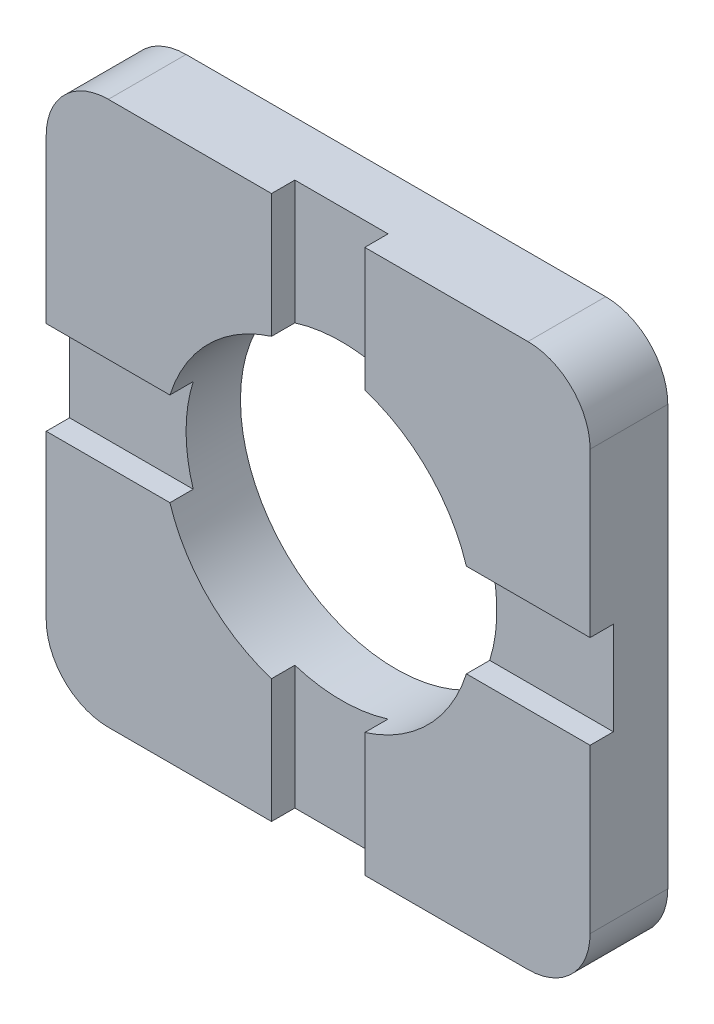
ISO-10303-21;
HEADER;
FILE_DESCRIPTION(('STEP AP214'),'2;1');
FILE_NAME('part.step','',(''),(''),'','','');
FILE_SCHEMA(('AUTOMOTIVE_DESIGN { 1 0 10303 214 1 1 1 1 }'));
ENDSEC;
DATA;
#1=APPLICATION_CONTEXT('core data for automotive mechanical design processes');
#2=APPLICATION_PROTOCOL_DEFINITION('international standard','automotive_design',2000,#1);
#3=PRODUCT_CONTEXT('',#1,'mechanical');
#4=PRODUCT('Part','Part','',(#3));
#5=PRODUCT_RELATED_PRODUCT_CATEGORY('part','',(#4));
#6=PRODUCT_DEFINITION_FORMATION('','',#4);
#7=PRODUCT_DEFINITION_CONTEXT('part definition',#1,'design');
#8=PRODUCT_DEFINITION('design','',#6,#7);
#9=PRODUCT_DEFINITION_SHAPE('','',#8);
#10=(LENGTH_UNIT() NAMED_UNIT(*) SI_UNIT(.MILLI.,.METRE.));
#11=(NAMED_UNIT(*) PLANE_ANGLE_UNIT() SI_UNIT($,.RADIAN.));
#12=(NAMED_UNIT(*) SI_UNIT($,.STERADIAN.) SOLID_ANGLE_UNIT());
#13=UNCERTAINTY_MEASURE_WITH_UNIT(LENGTH_MEASURE(1.E-05),#10,'distance_accuracy_value','');
#14=(GEOMETRIC_REPRESENTATION_CONTEXT(3) GLOBAL_UNCERTAINTY_ASSIGNED_CONTEXT((#13)) GLOBAL_UNIT_ASSIGNED_CONTEXT((#10,
#11,#12)) REPRESENTATION_CONTEXT('',''));
#15=CARTESIAN_POINT('',(0.,0.,0.));
#16=DIRECTION('',(0.,0.,1.));
#17=DIRECTION('',(1.,0.,0.));
#18=AXIS2_PLACEMENT_3D('',#15,#16,#17);
#19=CARTESIAN_POINT('',(0.,0.6,0.7));
#20=DIRECTION('',(0.,1.,0.));
#21=DIRECTION('',(0.,0.,1.));
#22=AXIS2_PLACEMENT_3D('',#19,#20,#21);
#23=PLANE('',#22);
#24=DIRECTION('',(0.,0.,1.));
#25=VECTOR('',#24,1.);
#26=CARTESIAN_POINT('',(-3.5,0.6,0.7));
#27=LINE('',#26,#25);
#28=CARTESIAN_POINT('',(-3.5,0.6,0.7));
#29=VERTEX_POINT('',#28);
#30=CARTESIAN_POINT('',(-3.5,0.6,1.));
#31=VERTEX_POINT('',#30);
#32=EDGE_CURVE('E257',#29,#31,#27,.T.);
#33=ORIENTED_EDGE('',*,*,#32,.F.);
#34=DIRECTION('',(1.,0.,0.));
#35=VECTOR('',#34,1.);
#36=CARTESIAN_POINT('',(0.,0.6,0.7));
#37=LINE('',#36,#35);
#38=CARTESIAN_POINT('',(-1.9078784028339,0.6,0.7));
#39=VERTEX_POINT('',#38);
#40=EDGE_CURVE('E342',#39,#29,#37,.F.);
#41=ORIENTED_EDGE('',*,*,#40,.F.);
#42=DIRECTION('',(0.,0.,1.));
#43=VECTOR('',#42,1.);
#44=CARTESIAN_POINT('',(-1.9078784028339,0.6,0.7));
#45=LINE('',#44,#43);
#46=CARTESIAN_POINT('',(-1.9078784028339,0.6,1.));
#47=VERTEX_POINT('',#46);
#48=EDGE_CURVE('E266',#47,#39,#45,.F.);
#49=ORIENTED_EDGE('',*,*,#48,.F.);
#50=DIRECTION('',(1.,0.,0.));
#51=VECTOR('',#50,1.);
#52=CARTESIAN_POINT('',(-2.7,0.6,1.));
#53=LINE('',#52,#51);
#54=EDGE_CURVE('E403',#31,#47,#53,.T.);
#55=ORIENTED_EDGE('',*,*,#54,.F.);
#56=EDGE_LOOP('',(#33,#41,#49,#55));
#57=FACE_BOUND('',#56,.T.);
#58=ADVANCED_FACE('F16',(#57),#23,.F.);
#59=CARTESIAN_POINT('',(-0.6,0.,0.7));
#60=DIRECTION('',(1.,0.,0.));
#61=DIRECTION('',(0.,0.,-1.));
#62=AXIS2_PLACEMENT_3D('',#59,#60,#61);
#63=PLANE('',#62);
#64=DIRECTION('',(0.,1.,0.));
#65=VECTOR('',#64,1.);
#66=CARTESIAN_POINT('',(-0.6,0.,0.7));
#67=LINE('',#66,#65);
#68=CARTESIAN_POINT('',(-0.6,3.5,0.7));
#69=VERTEX_POINT('',#68);
#70=CARTESIAN_POINT('',(-0.6,1.90787840283389,0.7));
#71=VERTEX_POINT('',#70);
#72=EDGE_CURVE('E409',#69,#71,#67,.F.);
#73=ORIENTED_EDGE('',*,*,#72,.F.);
#74=DIRECTION('',(0.,0.,-1.));
#75=VECTOR('',#74,1.);
#76=CARTESIAN_POINT('',(-0.6,3.5,0.7));
#77=LINE('',#76,#75);
#78=CARTESIAN_POINT('',(-0.6,3.5,1.));
#79=VERTEX_POINT('',#78);
#80=EDGE_CURVE('E243',#69,#79,#77,.F.);
#81=ORIENTED_EDGE('',*,*,#80,.T.);
#82=DIRECTION('',(0.,1.,0.));
#83=VECTOR('',#82,1.);
#84=CARTESIAN_POINT('',(-0.6,-2.7,1.));
#85=LINE('',#84,#83);
#86=CARTESIAN_POINT('',(-0.6,1.90787840283389,1.));
#87=VERTEX_POINT('',#86);
#88=EDGE_CURVE('E386',#87,#79,#85,.T.);
#89=ORIENTED_EDGE('',*,*,#88,.F.);
#90=DIRECTION('',(0.,0.,-1.));
#91=VECTOR('',#90,1.);
#92=CARTESIAN_POINT('',(-0.6,1.90787840283389,0.7));
#93=LINE('',#92,#91);
#94=EDGE_CURVE('E254',#87,#71,#93,.T.);
#95=ORIENTED_EDGE('',*,*,#94,.T.);
#96=EDGE_LOOP('',(#73,#81,#89,#95));
#97=FACE_BOUND('',#96,.T.);
#98=ADVANCED_FACE('F754',(#97),#63,.T.);
#99=CARTESIAN_POINT('',(0.,0.6,0.7));
#100=DIRECTION('',(0.,1.,0.));
#101=DIRECTION('',(0.,0.,1.));
#102=AXIS2_PLACEMENT_3D('',#99,#100,#101);
#103=PLANE('',#102);
#104=DIRECTION('',(0.,0.,1.));
#105=VECTOR('',#104,1.);
#106=CARTESIAN_POINT('',(1.90787840283389,0.6,0.7));
#107=LINE('',#106,#105);
#108=CARTESIAN_POINT('',(1.90787840283389,0.6,0.7));
#109=VERTEX_POINT('',#108);
#110=CARTESIAN_POINT('',(1.90787840283389,0.6,1.));
#111=VERTEX_POINT('',#110);
#112=EDGE_CURVE('E147',#109,#111,#107,.T.);
#113=ORIENTED_EDGE('',*,*,#112,.F.);
#114=DIRECTION('',(1.,0.,0.));
#115=VECTOR('',#114,1.);
#116=CARTESIAN_POINT('',(0.,0.6,0.7));
#117=LINE('',#116,#115);
#118=CARTESIAN_POINT('',(3.5,0.6,0.7));
#119=VERTEX_POINT('',#118);
#120=EDGE_CURVE('E154',#119,#109,#117,.F.);
#121=ORIENTED_EDGE('',*,*,#120,.F.);
#122=DIRECTION('',(0.,0.,1.));
#123=VECTOR('',#122,1.);
#124=CARTESIAN_POINT('',(3.5,0.6,0.7));
#125=LINE('',#124,#123);
#126=CARTESIAN_POINT('',(3.5,0.6,1.));
#127=VERTEX_POINT('',#126);
#128=EDGE_CURVE('E166',#127,#119,#125,.F.);
#129=ORIENTED_EDGE('',*,*,#128,.F.);
#130=DIRECTION('',(1.,0.,0.));
#131=VECTOR('',#130,1.);
#132=CARTESIAN_POINT('',(-2.7,0.6,1.));
#133=LINE('',#132,#131);
#134=EDGE_CURVE('E162',#111,#127,#133,.T.);
#135=ORIENTED_EDGE('',*,*,#134,.F.);
#136=EDGE_LOOP('',(#113,#121,#129,#135));
#137=FACE_BOUND('',#136,.T.);
#138=ADVANCED_FACE('F157',(#137),#103,.F.);
#139=CARTESIAN_POINT('',(0.6,0.,0.7));
#140=DIRECTION('',(1.,0.,0.));
#141=DIRECTION('',(0.,0.,-1.));
#142=AXIS2_PLACEMENT_3D('',#139,#140,#141);
#143=PLANE('',#142);
#144=DIRECTION('',(0.,0.,-1.));
#145=VECTOR('',#144,1.);
#146=CARTESIAN_POINT('',(0.6,3.5,0.7));
#147=LINE('',#146,#145);
#148=CARTESIAN_POINT('',(0.6,3.5,0.7));
#149=VERTEX_POINT('',#148);
#150=CARTESIAN_POINT('',(0.6,3.5,1.));
#151=VERTEX_POINT('',#150);
#152=EDGE_CURVE('E228',#149,#151,#147,.F.);
#153=ORIENTED_EDGE('',*,*,#152,.F.);
#154=DIRECTION('',(0.,1.,0.));
#155=VECTOR('',#154,1.);
#156=CARTESIAN_POINT('',(0.6,0.,0.7));
#157=LINE('',#156,#155);
#158=CARTESIAN_POINT('',(0.6,1.90787840283389,0.7));
#159=VERTEX_POINT('',#158);
#160=EDGE_CURVE('E415',#159,#149,#157,.T.);
#161=ORIENTED_EDGE('',*,*,#160,.F.);
#162=DIRECTION('',(0.,0.,-1.));
#163=VECTOR('',#162,1.);
#164=CARTESIAN_POINT('',(0.6,1.90787840283389,0.7));
#165=LINE('',#164,#163);
#166=CARTESIAN_POINT('',(0.6,1.90787840283389,1.));
#167=VERTEX_POINT('',#166);
#168=EDGE_CURVE('E165',#167,#159,#165,.T.);
#169=ORIENTED_EDGE('',*,*,#168,.F.);
#170=DIRECTION('',(0.,1.,0.));
#171=VECTOR('',#170,1.);
#172=CARTESIAN_POINT('',(0.6,-2.7,1.));
#173=LINE('',#172,#171);
#174=EDGE_CURVE('E424',#151,#167,#173,.F.);
#175=ORIENTED_EDGE('',*,*,#174,.F.);
#176=EDGE_LOOP('',(#153,#161,#169,#175));
#177=FACE_BOUND('',#176,.T.);
#178=ADVANCED_FACE('F735',(#177),#143,.F.);
#179=CARTESIAN_POINT('',(0.,-0.6,0.7));
#180=DIRECTION('',(0.,1.,0.));
#181=DIRECTION('',(0.,0.,1.));
#182=AXIS2_PLACEMENT_3D('',#179,#180,#181);
#183=PLANE('',#182);
#184=DIRECTION('',(1.,0.,0.));
#185=VECTOR('',#184,1.);
#186=CARTESIAN_POINT('',(0.,-0.6,0.7));
#187=LINE('',#186,#185);
#188=CARTESIAN_POINT('',(1.90787840283389,-0.6,0.7));
#189=VERTEX_POINT('',#188);
#190=CARTESIAN_POINT('',(3.5,-0.6,0.7));
#191=VERTEX_POINT('',#190);
#192=EDGE_CURVE('E153',#189,#191,#187,.T.);
#193=ORIENTED_EDGE('',*,*,#192,.F.);
#194=DIRECTION('',(0.,0.,1.));
#195=VECTOR('',#194,1.);
#196=CARTESIAN_POINT('',(1.90787840283389,-0.6,0.7));
#197=LINE('',#196,#195);
#198=CARTESIAN_POINT('',(1.90787840283389,-0.6,1.));
#199=VERTEX_POINT('',#198);
#200=EDGE_CURVE('E150',#189,#199,#197,.T.);
#201=ORIENTED_EDGE('',*,*,#200,.T.);
#202=DIRECTION('',(1.,0.,0.));
#203=VECTOR('',#202,1.);
#204=CARTESIAN_POINT('',(-2.7,-0.6,1.));
#205=LINE('',#204,#203);
#206=CARTESIAN_POINT('',(3.5,-0.6,1.));
#207=VERTEX_POINT('',#206);
#208=EDGE_CURVE('E430',#207,#199,#205,.F.);
#209=ORIENTED_EDGE('',*,*,#208,.F.);
#210=DIRECTION('',(0.,0.,1.));
#211=VECTOR('',#210,1.);
#212=CARTESIAN_POINT('',(3.5,-0.6,0.7));
#213=LINE('',#212,#211);
#214=EDGE_CURVE('E224',#207,#191,#213,.F.);
#215=ORIENTED_EDGE('',*,*,#214,.T.);
#216=EDGE_LOOP('',(#193,#201,#209,#215));
#217=FACE_BOUND('',#216,.T.);
#218=ADVANCED_FACE('F725',(#217),#183,.T.);
#219=CARTESIAN_POINT('',(0.6,0.,0.7));
#220=DIRECTION('',(1.,0.,0.));
#221=DIRECTION('',(0.,0.,-1.));
#222=AXIS2_PLACEMENT_3D('',#219,#220,#221);
#223=PLANE('',#222);
#224=DIRECTION('',(0.,0.,-1.));
#225=VECTOR('',#224,1.);
#226=CARTESIAN_POINT('',(0.6,-1.90787840283389,0.7));
#227=LINE('',#226,#225);
#228=CARTESIAN_POINT('',(0.6,-1.90787840283389,0.7));
#229=VERTEX_POINT('',#228);
#230=CARTESIAN_POINT('',(0.6,-1.90787840283389,1.));
#231=VERTEX_POINT('',#230);
#232=EDGE_CURVE('E205',#229,#231,#227,.F.);
#233=ORIENTED_EDGE('',*,*,#232,.F.);
#234=DIRECTION('',(0.,1.,0.));
#235=VECTOR('',#234,1.);
#236=CARTESIAN_POINT('',(0.6,0.,0.7));
#237=LINE('',#236,#235);
#238=CARTESIAN_POINT('',(0.6,-3.5,0.7));
#239=VERTEX_POINT('',#238);
#240=EDGE_CURVE('E448',#239,#229,#237,.T.);
#241=ORIENTED_EDGE('',*,*,#240,.F.);
#242=DIRECTION('',(0.,0.,-1.));
#243=VECTOR('',#242,1.);
#244=CARTESIAN_POINT('',(0.6,-3.5,0.7));
#245=LINE('',#244,#243);
#246=CARTESIAN_POINT('',(0.6,-3.5,1.));
#247=VERTEX_POINT('',#246);
#248=EDGE_CURVE('E212',#247,#239,#245,.T.);
#249=ORIENTED_EDGE('',*,*,#248,.F.);
#250=DIRECTION('',(0.,1.,0.));
#251=VECTOR('',#250,1.);
#252=CARTESIAN_POINT('',(0.6,-2.7,1.));
#253=LINE('',#252,#251);
#254=EDGE_CURVE('E436',#231,#247,#253,.F.);
#255=ORIENTED_EDGE('',*,*,#254,.F.);
#256=EDGE_LOOP('',(#233,#241,#249,#255));
#257=FACE_BOUND('',#256,.T.);
#258=ADVANCED_FACE('F715',(#257),#223,.F.);
#259=CARTESIAN_POINT('',(-0.6,0.,0.7));
#260=DIRECTION('',(1.,0.,0.));
#261=DIRECTION('',(0.,0.,-1.));
#262=AXIS2_PLACEMENT_3D('',#259,#260,#261);
#263=PLANE('',#262);
#264=DIRECTION('',(0.,1.,0.));
#265=VECTOR('',#264,1.);
#266=CARTESIAN_POINT('',(-0.6,0.,0.7));
#267=LINE('',#266,#265);
#268=CARTESIAN_POINT('',(-0.6,-1.90787840283389,0.7));
#269=VERTEX_POINT('',#268);
#270=CARTESIAN_POINT('',(-0.6,-3.5,0.7));
#271=VERTEX_POINT('',#270);
#272=EDGE_CURVE('E442',#269,#271,#267,.F.);
#273=ORIENTED_EDGE('',*,*,#272,.F.);
#274=DIRECTION('',(0.,0.,-1.));
#275=VECTOR('',#274,1.);
#276=CARTESIAN_POINT('',(-0.6,-1.90787840283389,0.7));
#277=LINE('',#276,#275);
#278=CARTESIAN_POINT('',(-0.6,-1.90787840283389,1.));
#279=VERTEX_POINT('',#278);
#280=EDGE_CURVE('E197',#269,#279,#277,.F.);
#281=ORIENTED_EDGE('',*,*,#280,.T.);
#282=DIRECTION('',(0.,1.,0.));
#283=VECTOR('',#282,1.);
#284=CARTESIAN_POINT('',(-0.6,-2.7,1.));
#285=LINE('',#284,#283);
#286=CARTESIAN_POINT('',(-0.6,-3.5,1.));
#287=VERTEX_POINT('',#286);
#288=EDGE_CURVE('E454',#287,#279,#285,.T.);
#289=ORIENTED_EDGE('',*,*,#288,.F.);
#290=DIRECTION('',(0.,0.,-1.));
#291=VECTOR('',#290,1.);
#292=CARTESIAN_POINT('',(-0.6,-3.5,0.7));
#293=LINE('',#292,#291);
#294=EDGE_CURVE('E201',#287,#271,#293,.T.);
#295=ORIENTED_EDGE('',*,*,#294,.T.);
#296=EDGE_LOOP('',(#273,#281,#289,#295));
#297=FACE_BOUND('',#296,.T.);
#298=ADVANCED_FACE('F705',(#297),#263,.T.);
#299=CARTESIAN_POINT('',(0.,-0.6,0.7));
#300=DIRECTION('',(0.,1.,0.));
#301=DIRECTION('',(0.,0.,1.));
#302=AXIS2_PLACEMENT_3D('',#299,#300,#301);
#303=PLANE('',#302);
#304=DIRECTION('',(1.,0.,0.));
#305=VECTOR('',#304,1.);
#306=CARTESIAN_POINT('',(0.,-0.6,0.7));
#307=LINE('',#306,#305);
#308=CARTESIAN_POINT('',(-3.5,-0.6,0.7));
#309=VERTEX_POINT('',#308);
#310=CARTESIAN_POINT('',(-1.90787840283389,-0.6,0.7));
#311=VERTEX_POINT('',#310);
#312=EDGE_CURVE('E349',#309,#311,#307,.T.);
#313=ORIENTED_EDGE('',*,*,#312,.F.);
#314=DIRECTION('',(0.,0.,1.));
#315=VECTOR('',#314,1.);
#316=CARTESIAN_POINT('',(-3.5,-0.6,0.7));
#317=LINE('',#316,#315);
#318=CARTESIAN_POINT('',(-3.5,-0.6,1.));
#319=VERTEX_POINT('',#318);
#320=EDGE_CURVE('E172',#309,#319,#317,.T.);
#321=ORIENTED_EDGE('',*,*,#320,.T.);
#322=DIRECTION('',(1.,0.,0.));
#323=VECTOR('',#322,1.);
#324=CARTESIAN_POINT('',(-2.7,-0.6,1.));
#325=LINE('',#324,#323);
#326=CARTESIAN_POINT('',(-1.90787840283389,-0.6,1.));
#327=VERTEX_POINT('',#326);
#328=EDGE_CURVE('E221',#327,#319,#325,.F.);
#329=ORIENTED_EDGE('',*,*,#328,.F.);
#330=DIRECTION('',(0.,0.,1.));
#331=VECTOR('',#330,1.);
#332=CARTESIAN_POINT('',(-1.90787840283389,-0.6,0.7));
#333=LINE('',#332,#331);
#334=EDGE_CURVE('E179',#327,#311,#333,.F.);
#335=ORIENTED_EDGE('',*,*,#334,.T.);
#336=EDGE_LOOP('',(#313,#321,#329,#335));
#337=FACE_BOUND('',#336,.T.);
#338=ADVANCED_FACE('F696',(#337),#303,.T.);
#339=CARTESIAN_POINT('',(0.,0.,0.7));
#340=DIRECTION('',(0.,0.,1.));
#341=DIRECTION('',(1.,0.,0.));
#342=AXIS2_PLACEMENT_3D('',#339,#340,#341);
#343=PLANE('',#342);
#344=CARTESIAN_POINT('',(0.,0.,0.7));
#345=DIRECTION('',(0.,0.,-1.));
#346=DIRECTION('',(-1.,0.,0.));
#347=AXIS2_PLACEMENT_3D('',#344,#345,#346);
#348=CIRCLE('',#347,2.);
#349=EDGE_CURVE('E19',#109,#189,#348,.T.);
#350=ORIENTED_EDGE('',*,*,#349,.T.);
#351=ORIENTED_EDGE('',*,*,#192,.T.);
#352=DIRECTION('',(0.,-1.,0.));
#353=VECTOR('',#352,1.);
#354=CARTESIAN_POINT('',(3.5,2.7,0.7));
#355=LINE('',#354,#353);
#356=EDGE_CURVE('E170',#191,#119,#355,.F.);
#357=ORIENTED_EDGE('',*,*,#356,.T.);
#358=ORIENTED_EDGE('',*,*,#120,.T.);
#359=EDGE_LOOP('',(#350,#351,#357,#358));
#360=FACE_BOUND('',#359,.T.);
#361=ADVANCED_FACE('F168',(#360),#343,.T.);
#362=CARTESIAN_POINT('',(0.,0.,0.7));
#363=DIRECTION('',(0.,0.,1.));
#364=DIRECTION('',(1.,0.,0.));
#365=AXIS2_PLACEMENT_3D('',#362,#363,#364);
#366=PLANE('',#365);
#367=DIRECTION('',(0.,1.,0.));
#368=VECTOR('',#367,1.);
#369=CARTESIAN_POINT('',(-3.5,2.7,0.7));
#370=LINE('',#369,#368);
#371=EDGE_CURVE('E272',#29,#309,#370,.F.);
#372=ORIENTED_EDGE('',*,*,#371,.T.);
#373=ORIENTED_EDGE('',*,*,#312,.T.);
#374=CARTESIAN_POINT('',(0.,0.,0.7));
#375=DIRECTION('',(0.,0.,-1.));
#376=DIRECTION('',(-1.,0.,0.));
#377=AXIS2_PLACEMENT_3D('',#374,#375,#376);
#378=CIRCLE('',#377,2.);
#379=EDGE_CURVE('E340',#311,#39,#378,.T.);
#380=ORIENTED_EDGE('',*,*,#379,.T.);
#381=ORIENTED_EDGE('',*,*,#40,.T.);
#382=EDGE_LOOP('',(#372,#373,#380,#381));
#383=FACE_BOUND('',#382,.T.);
#384=ADVANCED_FACE('F678',(#383),#366,.T.);
#385=CARTESIAN_POINT('',(-2.7,-2.7,1.));
#386=DIRECTION('',(0.,0.,1.));
#387=DIRECTION('',(1.,0.,0.));
#388=AXIS2_PLACEMENT_3D('',#385,#386,#387);
#389=PLANE('',#388);
#390=DIRECTION('',(0.,1.,0.));
#391=VECTOR('',#390,1.);
#392=CARTESIAN_POINT('',(-3.5,2.7,1.));
#393=LINE('',#392,#391);
#394=CARTESIAN_POINT('',(-3.5,2.7,1.));
#395=VERTEX_POINT('',#394);
#396=EDGE_CURVE('E277',#395,#31,#393,.F.);
#397=ORIENTED_EDGE('',*,*,#396,.T.);
#398=ORIENTED_EDGE('',*,*,#54,.T.);
#399=CARTESIAN_POINT('',(0.,0.,1.));
#400=DIRECTION('',(0.,0.,-1.));
#401=DIRECTION('',(-1.,0.,0.));
#402=AXIS2_PLACEMENT_3D('',#399,#400,#401);
#403=CIRCLE('',#402,2.);
#404=EDGE_CURVE('E323',#47,#87,#403,.T.);
#405=ORIENTED_EDGE('',*,*,#404,.T.);
#406=ORIENTED_EDGE('',*,*,#88,.T.);
#407=DIRECTION('',(1.,0.,0.));
#408=VECTOR('',#407,1.);
#409=CARTESIAN_POINT('',(-2.7,3.5,1.));
#410=LINE('',#409,#408);
#411=CARTESIAN_POINT('',(-2.7,3.5,1.));
#412=VERTEX_POINT('',#411);
#413=EDGE_CURVE('E370',#79,#412,#410,.F.);
#414=ORIENTED_EDGE('',*,*,#413,.T.);
#415=CARTESIAN_POINT('',(-2.7,2.7,1.));
#416=DIRECTION('',(0.,0.,-1.));
#417=DIRECTION('',(-1.,0.,0.));
#418=AXIS2_PLACEMENT_3D('',#415,#416,#417);
#419=CIRCLE('',#418,0.8);
#420=EDGE_CURVE('E250',#395,#412,#419,.T.);
#421=ORIENTED_EDGE('',*,*,#420,.F.);
#422=EDGE_LOOP('',(#397,#398,#405,#406,#414,#421));
#423=FACE_BOUND('',#422,.T.);
#424=ADVANCED_FACE('F668',(#423),#389,.T.);
#425=CARTESIAN_POINT('',(0.,0.,0.7));
#426=DIRECTION('',(0.,0.,1.));
#427=DIRECTION('',(1.,0.,0.));
#428=AXIS2_PLACEMENT_3D('',#425,#426,#427);
#429=PLANE('',#428);
#430=ORIENTED_EDGE('',*,*,#160,.T.);
#431=DIRECTION('',(1.,0.,0.));
#432=VECTOR('',#431,1.);
#433=CARTESIAN_POINT('',(-2.7,3.5,0.7));
#434=LINE('',#433,#432);
#435=EDGE_CURVE('E246',#149,#69,#434,.F.);
#436=ORIENTED_EDGE('',*,*,#435,.T.);
#437=ORIENTED_EDGE('',*,*,#72,.T.);
#438=CARTESIAN_POINT('',(0.,0.,0.7));
#439=DIRECTION('',(0.,0.,-1.));
#440=DIRECTION('',(-1.,0.,0.));
#441=AXIS2_PLACEMENT_3D('',#438,#439,#440);
#442=CIRCLE('',#441,2.);
#443=EDGE_CURVE('E319',#71,#159,#442,.T.);
#444=ORIENTED_EDGE('',*,*,#443,.T.);
#445=EDGE_LOOP('',(#430,#436,#437,#444));
#446=FACE_BOUND('',#445,.T.);
#447=ADVANCED_FACE('F658',(#446),#429,.T.);
#448=CARTESIAN_POINT('',(-2.7,-2.7,1.));
#449=DIRECTION('',(0.,0.,1.));
#450=DIRECTION('',(1.,0.,0.));
#451=AXIS2_PLACEMENT_3D('',#448,#449,#450);
#452=PLANE('',#451);
#453=ORIENTED_EDGE('',*,*,#174,.T.);
#454=CARTESIAN_POINT('',(0.,0.,1.));
#455=DIRECTION('',(0.,0.,-1.));
#456=DIRECTION('',(-1.,0.,0.));
#457=AXIS2_PLACEMENT_3D('',#454,#455,#456);
#458=CIRCLE('',#457,2.);
#459=EDGE_CURVE('E316',#167,#111,#458,.T.);
#460=ORIENTED_EDGE('',*,*,#459,.T.);
#461=ORIENTED_EDGE('',*,*,#134,.T.);
#462=DIRECTION('',(0.,-1.,0.));
#463=VECTOR('',#462,1.);
#464=CARTESIAN_POINT('',(3.5,2.7,1.));
#465=LINE('',#464,#463);
#466=CARTESIAN_POINT('',(3.5,2.7,1.));
#467=VERTEX_POINT('',#466);
#468=EDGE_CURVE('E282',#127,#467,#465,.F.);
#469=ORIENTED_EDGE('',*,*,#468,.T.);
#470=CARTESIAN_POINT('',(2.7,2.7,1.));
#471=DIRECTION('',(0.,0.,-1.));
#472=DIRECTION('',(-1.,0.,0.));
#473=AXIS2_PLACEMENT_3D('',#470,#471,#472);
#474=CIRCLE('',#473,0.8);
#475=CARTESIAN_POINT('',(2.7,3.5,1.));
#476=VERTEX_POINT('',#475);
#477=EDGE_CURVE('E333',#476,#467,#474,.T.);
#478=ORIENTED_EDGE('',*,*,#477,.F.);
#479=DIRECTION('',(1.,0.,0.));
#480=VECTOR('',#479,1.);
#481=CARTESIAN_POINT('',(-2.7,3.5,1.));
#482=LINE('',#481,#480);
#483=EDGE_CURVE('E251',#476,#151,#482,.F.);
#484=ORIENTED_EDGE('',*,*,#483,.T.);
#485=EDGE_LOOP('',(#453,#460,#461,#469,#478,#484));
#486=FACE_BOUND('',#485,.T.);
#487=ADVANCED_FACE('F648',(#486),#452,.T.);
#488=CARTESIAN_POINT('',(-2.7,-2.7,1.));
#489=DIRECTION('',(0.,0.,1.));
#490=DIRECTION('',(1.,0.,0.));
#491=AXIS2_PLACEMENT_3D('',#488,#489,#490);
#492=PLANE('',#491);
#493=DIRECTION('',(-1.,0.,0.));
#494=VECTOR('',#493,1.);
#495=CARTESIAN_POINT('',(-2.7,-3.5,1.));
#496=LINE('',#495,#494);
#497=CARTESIAN_POINT('',(2.7,-3.5,1.));
#498=VERTEX_POINT('',#497);
#499=EDGE_CURVE('E187',#247,#498,#496,.F.);
#500=ORIENTED_EDGE('',*,*,#499,.T.);
#501=CARTESIAN_POINT('',(2.7,-2.7,1.));
#502=DIRECTION('',(0.,0.,-1.));
#503=DIRECTION('',(-1.,0.,0.));
#504=AXIS2_PLACEMENT_3D('',#501,#502,#503);
#505=CIRCLE('',#504,0.799999999999999);
#506=CARTESIAN_POINT('',(3.5,-2.7,1.));
#507=VERTEX_POINT('',#506);
#508=EDGE_CURVE('E338',#507,#498,#505,.T.);
#509=ORIENTED_EDGE('',*,*,#508,.F.);
#510=DIRECTION('',(0.,-1.,0.));
#511=VECTOR('',#510,1.);
#512=CARTESIAN_POINT('',(3.5,2.7,1.));
#513=LINE('',#512,#511);
#514=EDGE_CURVE('E337',#507,#207,#513,.F.);
#515=ORIENTED_EDGE('',*,*,#514,.T.);
#516=ORIENTED_EDGE('',*,*,#208,.T.);
#517=CARTESIAN_POINT('',(0.,0.,1.));
#518=DIRECTION('',(0.,0.,-1.));
#519=DIRECTION('',(-1.,0.,0.));
#520=AXIS2_PLACEMENT_3D('',#517,#518,#519);
#521=CIRCLE('',#520,2.);
#522=EDGE_CURVE('E312',#199,#231,#521,.T.);
#523=ORIENTED_EDGE('',*,*,#522,.T.);
#524=ORIENTED_EDGE('',*,*,#254,.T.);
#525=EDGE_LOOP('',(#500,#509,#515,#516,#523,#524));
#526=FACE_BOUND('',#525,.T.);
#527=ADVANCED_FACE('F638',(#526),#492,.T.);
#528=CARTESIAN_POINT('',(0.,0.,0.7));
#529=DIRECTION('',(0.,0.,1.));
#530=DIRECTION('',(1.,0.,0.));
#531=AXIS2_PLACEMENT_3D('',#528,#529,#530);
#532=PLANE('',#531);
#533=ORIENTED_EDGE('',*,*,#240,.T.);
#534=CARTESIAN_POINT('',(0.,0.,0.7));
#535=DIRECTION('',(0.,0.,-1.));
#536=DIRECTION('',(-1.,0.,0.));
#537=AXIS2_PLACEMENT_3D('',#534,#535,#536);
#538=CIRCLE('',#537,2.);
#539=EDGE_CURVE('E308',#229,#269,#538,.T.);
#540=ORIENTED_EDGE('',*,*,#539,.T.);
#541=ORIENTED_EDGE('',*,*,#272,.T.);
#542=DIRECTION('',(-1.,0.,0.));
#543=VECTOR('',#542,1.);
#544=CARTESIAN_POINT('',(-2.7,-3.5,0.7));
#545=LINE('',#544,#543);
#546=EDGE_CURVE('E192',#271,#239,#545,.F.);
#547=ORIENTED_EDGE('',*,*,#546,.T.);
#548=EDGE_LOOP('',(#533,#540,#541,#547));
#549=FACE_BOUND('',#548,.T.);
#550=ADVANCED_FACE('F628',(#549),#532,.T.);
#551=CARTESIAN_POINT('',(-2.7,-2.7,1.));
#552=DIRECTION('',(0.,0.,1.));
#553=DIRECTION('',(1.,0.,0.));
#554=AXIS2_PLACEMENT_3D('',#551,#552,#553);
#555=PLANE('',#554);
#556=DIRECTION('',(0.,1.,0.));
#557=VECTOR('',#556,1.);
#558=CARTESIAN_POINT('',(-3.5,2.7,1.));
#559=LINE('',#558,#557);
#560=CARTESIAN_POINT('',(-3.5,-2.7,1.));
#561=VERTEX_POINT('',#560);
#562=EDGE_CURVE('E394',#319,#561,#559,.F.);
#563=ORIENTED_EDGE('',*,*,#562,.T.);
#564=CARTESIAN_POINT('',(-2.7,-2.7,1.));
#565=DIRECTION('',(0.,0.,-1.));
#566=DIRECTION('',(-1.,0.,0.));
#567=AXIS2_PLACEMENT_3D('',#564,#565,#566);
#568=CIRCLE('',#567,0.8);
#569=CARTESIAN_POINT('',(-2.7,-3.5,1.));
#570=VERTEX_POINT('',#569);
#571=EDGE_CURVE('E327',#570,#561,#568,.T.);
#572=ORIENTED_EDGE('',*,*,#571,.F.);
#573=DIRECTION('',(-1.,0.,0.));
#574=VECTOR('',#573,1.);
#575=CARTESIAN_POINT('',(-2.7,-3.5,1.));
#576=LINE('',#575,#574);
#577=EDGE_CURVE('E191',#570,#287,#576,.F.);
#578=ORIENTED_EDGE('',*,*,#577,.T.);
#579=ORIENTED_EDGE('',*,*,#288,.T.);
#580=CARTESIAN_POINT('',(0.,0.,1.));
#581=DIRECTION('',(0.,0.,-1.));
#582=DIRECTION('',(-1.,0.,0.));
#583=AXIS2_PLACEMENT_3D('',#580,#581,#582);
#584=CIRCLE('',#583,2.);
#585=EDGE_CURVE('E304',#279,#327,#584,.T.);
#586=ORIENTED_EDGE('',*,*,#585,.T.);
#587=ORIENTED_EDGE('',*,*,#328,.T.);
#588=EDGE_LOOP('',(#563,#572,#578,#579,#586,#587));
#589=FACE_BOUND('',#588,.T.);
#590=ADVANCED_FACE('F619',(#589),#555,.T.);
#591=CARTESIAN_POINT('',(-2.7,-3.5,1.));
#592=DIRECTION('',(0.,1.,0.));
#593=DIRECTION('',(-1.,0.,0.));
#594=AXIS2_PLACEMENT_3D('',#591,#592,#593);
#595=PLANE('',#594);
#596=ORIENTED_EDGE('',*,*,#577,.F.);
#597=DIRECTION('',(0.,0.,-1.));
#598=VECTOR('',#597,1.);
#599=CARTESIAN_POINT('',(-2.7,-3.5,1.));
#600=LINE('',#599,#598);
#601=CARTESIAN_POINT('',(-2.7,-3.5,0.));
#602=VERTEX_POINT('',#601);
#603=EDGE_CURVE('E276',#602,#570,#600,.F.);
#604=ORIENTED_EDGE('',*,*,#603,.F.);
#605=DIRECTION('',(1.,0.,0.));
#606=VECTOR('',#605,1.);
#607=CARTESIAN_POINT('',(-2.7,-3.5,0.));
#608=LINE('',#607,#606);
#609=CARTESIAN_POINT('',(2.7,-3.5,0.));
#610=VERTEX_POINT('',#609);
#611=EDGE_CURVE('E303',#602,#610,#608,.T.);
#612=ORIENTED_EDGE('',*,*,#611,.T.);
#613=DIRECTION('',(0.,0.,-1.));
#614=VECTOR('',#613,1.);
#615=CARTESIAN_POINT('',(2.7,-3.5,1.));
#616=LINE('',#615,#614);
#617=EDGE_CURVE('E283',#498,#610,#616,.T.);
#618=ORIENTED_EDGE('',*,*,#617,.F.);
#619=ORIENTED_EDGE('',*,*,#499,.F.);
#620=ORIENTED_EDGE('',*,*,#248,.T.);
#621=ORIENTED_EDGE('',*,*,#546,.F.);
#622=ORIENTED_EDGE('',*,*,#294,.F.);
#623=EDGE_LOOP('',(#596,#604,#612,#618,#619,#620,#621,#622));
#624=FACE_BOUND('',#623,.T.);
#625=ADVANCED_FACE('F529',(#624),#595,.F.);
#626=CARTESIAN_POINT('',(2.7,-2.7,1.));
#627=DIRECTION('',(0.,0.,-1.));
#628=DIRECTION('',(-1.,0.,0.));
#629=AXIS2_PLACEMENT_3D('',#626,#627,#628);
#630=CYLINDRICAL_SURFACE('',#629,0.799999999999999);
#631=ORIENTED_EDGE('',*,*,#508,.T.);
#632=ORIENTED_EDGE('',*,*,#617,.T.);
#633=CARTESIAN_POINT('',(2.7,-2.7,0.));
#634=DIRECTION('',(0.,0.,-1.));
#635=DIRECTION('',(-1.,0.,0.));
#636=AXIS2_PLACEMENT_3D('',#633,#634,#635);
#637=CIRCLE('',#636,0.799999999999999);
#638=CARTESIAN_POINT('',(3.5,-2.7,0.));
#639=VERTEX_POINT('',#638);
#640=EDGE_CURVE('E299',#610,#639,#637,.F.);
#641=ORIENTED_EDGE('',*,*,#640,.T.);
#642=DIRECTION('',(0.,0.,1.));
#643=VECTOR('',#642,1.);
#644=CARTESIAN_POINT('',(3.5,-2.7,1.));
#645=LINE('',#644,#643);
#646=EDGE_CURVE('E358',#639,#507,#645,.T.);
#647=ORIENTED_EDGE('',*,*,#646,.T.);
#648=EDGE_LOOP('',(#631,#632,#641,#647));
#649=FACE_BOUND('',#648,.T.);
#650=ADVANCED_FACE('F525',(#649),#630,.T.);
#651=CARTESIAN_POINT('',(3.5,2.7,1.));
#652=DIRECTION('',(-1.,0.,0.));
#653=DIRECTION('',(0.,-1.,0.));
#654=AXIS2_PLACEMENT_3D('',#651,#652,#653);
#655=PLANE('',#654);
#656=ORIENTED_EDGE('',*,*,#514,.F.);
#657=ORIENTED_EDGE('',*,*,#646,.F.);
#658=DIRECTION('',(0.,1.,0.));
#659=VECTOR('',#658,1.);
#660=CARTESIAN_POINT('',(3.5,-2.7,0.));
#661=LINE('',#660,#659);
#662=CARTESIAN_POINT('',(3.5,2.7,0.));
#663=VERTEX_POINT('',#662);
#664=EDGE_CURVE('E298',#639,#663,#661,.T.);
#665=ORIENTED_EDGE('',*,*,#664,.T.);
#666=DIRECTION('',(0.,0.,-1.));
#667=VECTOR('',#666,1.);
#668=CARTESIAN_POINT('',(3.5,2.7,1.));
#669=LINE('',#668,#667);
#670=EDGE_CURVE('E336',#467,#663,#669,.T.);
#671=ORIENTED_EDGE('',*,*,#670,.F.);
#672=ORIENTED_EDGE('',*,*,#468,.F.);
#673=ORIENTED_EDGE('',*,*,#128,.T.);
#674=ORIENTED_EDGE('',*,*,#356,.F.);
#675=ORIENTED_EDGE('',*,*,#214,.F.);
#676=EDGE_LOOP('',(#656,#657,#665,#671,#672,#673,#674,#675));
#677=FACE_BOUND('',#676,.T.);
#678=ADVANCED_FACE('F522',(#677),#655,.F.);
#679=CARTESIAN_POINT('',(2.7,2.7,1.));
#680=DIRECTION('',(0.,0.,-1.));
#681=DIRECTION('',(-1.,0.,0.));
#682=AXIS2_PLACEMENT_3D('',#679,#680,#681);
#683=CYLINDRICAL_SURFACE('',#682,0.8);
#684=ORIENTED_EDGE('',*,*,#477,.T.);
#685=ORIENTED_EDGE('',*,*,#670,.T.);
#686=CARTESIAN_POINT('',(2.7,2.7,0.));
#687=DIRECTION('',(0.,0.,-1.));
#688=DIRECTION('',(-1.,0.,0.));
#689=AXIS2_PLACEMENT_3D('',#686,#687,#688);
#690=CIRCLE('',#689,0.8);
#691=CARTESIAN_POINT('',(2.7,3.5,0.));
#692=VERTEX_POINT('',#691);
#693=EDGE_CURVE('E294',#663,#692,#690,.F.);
#694=ORIENTED_EDGE('',*,*,#693,.T.);
#695=DIRECTION('',(0.,0.,1.));
#696=VECTOR('',#695,1.);
#697=CARTESIAN_POINT('',(2.7,3.5,1.));
#698=LINE('',#697,#696);
#699=EDGE_CURVE('E367',#692,#476,#698,.T.);
#700=ORIENTED_EDGE('',*,*,#699,.T.);
#701=EDGE_LOOP('',(#684,#685,#694,#700));
#702=FACE_BOUND('',#701,.T.);
#703=ADVANCED_FACE('F517',(#702),#683,.T.);
#704=CARTESIAN_POINT('',(-2.7,3.5,1.));
#705=DIRECTION('',(0.,-1.,0.));
#706=DIRECTION('',(1.,0.,0.));
#707=AXIS2_PLACEMENT_3D('',#704,#705,#706);
#708=PLANE('',#707);
#709=ORIENTED_EDGE('',*,*,#435,.F.);
#710=ORIENTED_EDGE('',*,*,#152,.T.);
#711=ORIENTED_EDGE('',*,*,#483,.F.);
#712=ORIENTED_EDGE('',*,*,#699,.F.);
#713=DIRECTION('',(1.,0.,0.));
#714=VECTOR('',#713,1.);
#715=CARTESIAN_POINT('',(-2.7,3.5,0.));
#716=LINE('',#715,#714);
#717=CARTESIAN_POINT('',(-2.7,3.5,0.));
#718=VERTEX_POINT('',#717);
#719=EDGE_CURVE('E293',#692,#718,#716,.F.);
#720=ORIENTED_EDGE('',*,*,#719,.T.);
#721=DIRECTION('',(0.,0.,-1.));
#722=VECTOR('',#721,1.);
#723=CARTESIAN_POINT('',(-2.7,3.5,1.));
#724=LINE('',#723,#722);
#725=EDGE_CURVE('E332',#412,#718,#724,.T.);
#726=ORIENTED_EDGE('',*,*,#725,.F.);
#727=ORIENTED_EDGE('',*,*,#413,.F.);
#728=ORIENTED_EDGE('',*,*,#80,.F.);
#729=EDGE_LOOP('',(#709,#710,#711,#712,#720,#726,#727,#728));
#730=FACE_BOUND('',#729,.T.);
#731=ADVANCED_FACE('F511',(#730),#708,.F.);
#732=CARTESIAN_POINT('',(-2.7,2.7,1.));
#733=DIRECTION('',(0.,0.,-1.));
#734=DIRECTION('',(-1.,0.,0.));
#735=AXIS2_PLACEMENT_3D('',#732,#733,#734);
#736=CYLINDRICAL_SURFACE('',#735,0.8);
#737=ORIENTED_EDGE('',*,*,#420,.T.);
#738=ORIENTED_EDGE('',*,*,#725,.T.);
#739=CARTESIAN_POINT('',(-2.7,2.7,0.));
#740=DIRECTION('',(0.,0.,-1.));
#741=DIRECTION('',(-1.,0.,0.));
#742=AXIS2_PLACEMENT_3D('',#739,#740,#741);
#743=CIRCLE('',#742,0.8);
#744=CARTESIAN_POINT('',(-3.5,2.7,0.));
#745=VERTEX_POINT('',#744);
#746=EDGE_CURVE('E289',#718,#745,#743,.F.);
#747=ORIENTED_EDGE('',*,*,#746,.T.);
#748=DIRECTION('',(0.,0.,1.));
#749=VECTOR('',#748,1.);
#750=CARTESIAN_POINT('',(-3.5,2.7,1.));
#751=LINE('',#750,#749);
#752=EDGE_CURVE('E379',#745,#395,#751,.T.);
#753=ORIENTED_EDGE('',*,*,#752,.T.);
#754=EDGE_LOOP('',(#737,#738,#747,#753));
#755=FACE_BOUND('',#754,.T.);
#756=ADVANCED_FACE('F506',(#755),#736,.T.);
#757=CARTESIAN_POINT('',(-3.5,2.7,1.));
#758=DIRECTION('',(1.,0.,0.));
#759=DIRECTION('',(0.,1.,0.));
#760=AXIS2_PLACEMENT_3D('',#757,#758,#759);
#761=PLANE('',#760);
#762=ORIENTED_EDGE('',*,*,#371,.F.);
#763=ORIENTED_EDGE('',*,*,#32,.T.);
#764=ORIENTED_EDGE('',*,*,#396,.F.);
#765=ORIENTED_EDGE('',*,*,#752,.F.);
#766=DIRECTION('',(0.,1.,0.));
#767=VECTOR('',#766,1.);
#768=CARTESIAN_POINT('',(-3.5,-2.7,0.));
#769=LINE('',#768,#767);
#770=CARTESIAN_POINT('',(-3.5,-2.7,0.));
#771=VERTEX_POINT('',#770);
#772=EDGE_CURVE('E288',#745,#771,#769,.F.);
#773=ORIENTED_EDGE('',*,*,#772,.T.);
#774=DIRECTION('',(0.,0.,-1.));
#775=VECTOR('',#774,1.);
#776=CARTESIAN_POINT('',(-3.5,-2.7,1.));
#777=LINE('',#776,#775);
#778=EDGE_CURVE('E35',#561,#771,#777,.T.);
#779=ORIENTED_EDGE('',*,*,#778,.F.);
#780=ORIENTED_EDGE('',*,*,#562,.F.);
#781=ORIENTED_EDGE('',*,*,#320,.F.);
#782=EDGE_LOOP('',(#762,#763,#764,#765,#773,#779,#780,#781));
#783=FACE_BOUND('',#782,.T.);
#784=ADVANCED_FACE('F498',(#783),#761,.F.);
#785=CARTESIAN_POINT('',(-2.7,-2.7,1.));
#786=DIRECTION('',(0.,0.,-1.));
#787=DIRECTION('',(-1.,0.,0.));
#788=AXIS2_PLACEMENT_3D('',#785,#786,#787);
#789=CYLINDRICAL_SURFACE('',#788,0.8);
#790=ORIENTED_EDGE('',*,*,#571,.T.);
#791=ORIENTED_EDGE('',*,*,#778,.T.);
#792=CARTESIAN_POINT('',(-2.7,-2.7,0.));
#793=DIRECTION('',(0.,0.,-1.));
#794=DIRECTION('',(-1.,0.,0.));
#795=AXIS2_PLACEMENT_3D('',#792,#793,#794);
#796=CIRCLE('',#795,0.8);
#797=EDGE_CURVE('E26',#771,#602,#796,.F.);
#798=ORIENTED_EDGE('',*,*,#797,.T.);
#799=ORIENTED_EDGE('',*,*,#603,.T.);
#800=EDGE_LOOP('',(#790,#791,#798,#799));
#801=FACE_BOUND('',#800,.T.);
#802=ADVANCED_FACE('F534',(#801),#789,.T.);
#803=CARTESIAN_POINT('',(0.,0.,1.));
#804=DIRECTION('',(0.,0.,-1.));
#805=DIRECTION('',(-1.,0.,0.));
#806=AXIS2_PLACEMENT_3D('',#803,#804,#805);
#807=CYLINDRICAL_SURFACE('',#806,2.);
#808=CARTESIAN_POINT('',(0.,0.,0.));
#809=DIRECTION('',(0.,0.,-1.));
#810=DIRECTION('',(-1.,0.,0.));
#811=AXIS2_PLACEMENT_3D('',#808,#809,#810);
#812=CIRCLE('',#811,2.);
#813=CARTESIAN_POINT('',(-2.,0.,0.));
#814=VERTEX_POINT('',#813);
#815=EDGE_CURVE('E11',#814,#814,#812,.T.);
#816=ORIENTED_EDGE('',*,*,#815,.T.);
#817=EDGE_LOOP('',(#816));
#818=FACE_BOUND('',#817,.T.);
#819=ORIENTED_EDGE('',*,*,#349,.F.);
#820=ORIENTED_EDGE('',*,*,#112,.T.);
#821=ORIENTED_EDGE('',*,*,#459,.F.);
#822=ORIENTED_EDGE('',*,*,#168,.T.);
#823=ORIENTED_EDGE('',*,*,#443,.F.);
#824=ORIENTED_EDGE('',*,*,#94,.F.);
#825=ORIENTED_EDGE('',*,*,#404,.F.);
#826=ORIENTED_EDGE('',*,*,#48,.T.);
#827=ORIENTED_EDGE('',*,*,#379,.F.);
#828=ORIENTED_EDGE('',*,*,#334,.F.);
#829=ORIENTED_EDGE('',*,*,#585,.F.);
#830=ORIENTED_EDGE('',*,*,#280,.F.);
#831=ORIENTED_EDGE('',*,*,#539,.F.);
#832=ORIENTED_EDGE('',*,*,#232,.T.);
#833=ORIENTED_EDGE('',*,*,#522,.F.);
#834=ORIENTED_EDGE('',*,*,#200,.F.);
#835=EDGE_LOOP('',(#819,#820,#821,#822,#823,#824,#825,#826,#827,#828,#829,#830,#831,#832,#833,#834));
#836=FACE_BOUND('',#835,.T.);
#837=ADVANCED_FACE('F145',(#818,#836),#807,.F.);
#838=CARTESIAN_POINT('',(-2.7,-2.7,0.));
#839=DIRECTION('',(0.,0.,1.));
#840=DIRECTION('',(1.,0.,0.));
#841=AXIS2_PLACEMENT_3D('',#838,#839,#840);
#842=PLANE('',#841);
#843=ORIENTED_EDGE('',*,*,#815,.F.);
#844=EDGE_LOOP('',(#843));
#845=FACE_BOUND('',#844,.T.);
#846=ORIENTED_EDGE('',*,*,#772,.F.);
#847=ORIENTED_EDGE('',*,*,#746,.F.);
#848=ORIENTED_EDGE('',*,*,#719,.F.);
#849=ORIENTED_EDGE('',*,*,#693,.F.);
#850=ORIENTED_EDGE('',*,*,#664,.F.);
#851=ORIENTED_EDGE('',*,*,#640,.F.);
#852=ORIENTED_EDGE('',*,*,#611,.F.);
#853=ORIENTED_EDGE('',*,*,#797,.F.);
#854=EDGE_LOOP('',(#846,#847,#848,#849,#850,#851,#852,#853));
#855=FACE_BOUND('',#854,.T.);
#856=ADVANCED_FACE('F503',(#845,#855),#842,.F.);
#857=CLOSED_SHELL('',(#58,#98,#138,#178,#218,#258,#298,#338,#361,#384,#424,#447,#487,#527,#550,
#590,#625,#650,#678,#703,#731,#756,#784,#802,#837,#856));
#858=MANIFOLD_SOLID_BREP('B1',#857);
#859=ADVANCED_BREP_SHAPE_REPRESENTATION('',(#18,#858),#14);
#860=SHAPE_DEFINITION_REPRESENTATION(#9,#859);
ENDSEC;
END-ISO-10303-21;
